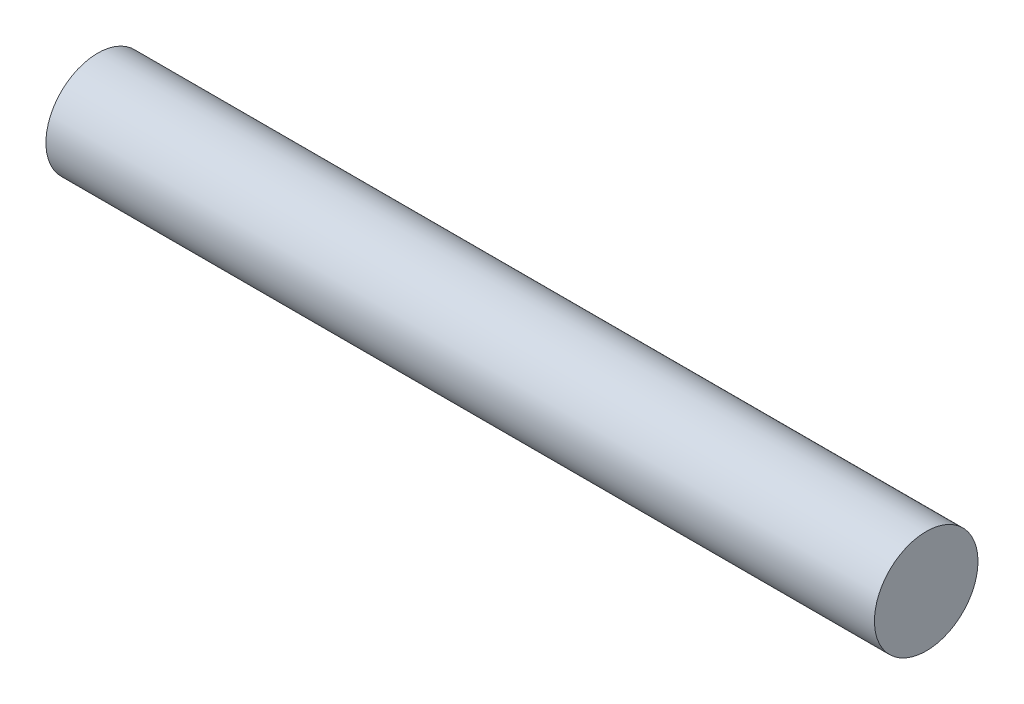
ISO-10303-21;
HEADER;
FILE_DESCRIPTION(('STEP AP214'),'2;1');
FILE_NAME('part.step','',(''),(''),'','','');
FILE_SCHEMA(('AUTOMOTIVE_DESIGN { 1 0 10303 214 1 1 1 1 }'));
ENDSEC;
DATA;
#1=APPLICATION_CONTEXT('core data for automotive mechanical design processes');
#2=APPLICATION_PROTOCOL_DEFINITION('international standard','automotive_design',2000,#1);
#3=PRODUCT_CONTEXT('',#1,'mechanical');
#4=PRODUCT('Part','Part','',(#3));
#5=PRODUCT_RELATED_PRODUCT_CATEGORY('part','',(#4));
#6=PRODUCT_DEFINITION_FORMATION('','',#4);
#7=PRODUCT_DEFINITION_CONTEXT('part definition',#1,'design');
#8=PRODUCT_DEFINITION('design','',#6,#7);
#9=PRODUCT_DEFINITION_SHAPE('','',#8);
#10=(LENGTH_UNIT() NAMED_UNIT(*) SI_UNIT(.MILLI.,.METRE.));
#11=(NAMED_UNIT(*) PLANE_ANGLE_UNIT() SI_UNIT($,.RADIAN.));
#12=(NAMED_UNIT(*) SI_UNIT($,.STERADIAN.) SOLID_ANGLE_UNIT());
#13=UNCERTAINTY_MEASURE_WITH_UNIT(LENGTH_MEASURE(1.E-05),#10,'distance_accuracy_value','');
#14=(GEOMETRIC_REPRESENTATION_CONTEXT(3) GLOBAL_UNCERTAINTY_ASSIGNED_CONTEXT((#13)) GLOBAL_UNIT_ASSIGNED_CONTEXT((#10,
#11,#12)) REPRESENTATION_CONTEXT('',''));
#15=CARTESIAN_POINT('',(0.,0.,0.));
#16=DIRECTION('',(0.,0.,1.));
#17=DIRECTION('',(1.,0.,0.));
#18=AXIS2_PLACEMENT_3D('',#15,#16,#17);
#19=CARTESIAN_POINT('',(16.,0.,0.));
#20=DIRECTION('',(-1.,0.,0.));
#21=DIRECTION('',(0.,0.,1.));
#22=AXIS2_PLACEMENT_3D('',#19,#20,#21);
#23=CYLINDRICAL_SURFACE('',#22,1.);
#24=CARTESIAN_POINT('',(16.,0.,0.));
#25=DIRECTION('',(1.,0.,0.));
#26=DIRECTION('',(0.,0.,-1.));
#27=AXIS2_PLACEMENT_3D('',#24,#25,#26);
#28=CIRCLE('',#27,1.);
#29=CARTESIAN_POINT('',(16.,0.,-1.));
#30=VERTEX_POINT('',#29);
#31=EDGE_CURVE('E10',#30,#30,#28,.T.);
#32=ORIENTED_EDGE('',*,*,#31,.F.);
#33=EDGE_LOOP('',(#32));
#34=FACE_BOUND('',#33,.T.);
#35=CARTESIAN_POINT('',(0.,0.,0.));
#36=DIRECTION('',(1.,0.,0.));
#37=DIRECTION('',(0.,0.,-1.));
#38=AXIS2_PLACEMENT_3D('',#35,#36,#37);
#39=CIRCLE('',#38,1.);
#40=CARTESIAN_POINT('',(0.,0.,-1.));
#41=VERTEX_POINT('',#40);
#42=EDGE_CURVE('E33',#41,#41,#39,.T.);
#43=ORIENTED_EDGE('',*,*,#42,.T.);
#44=EDGE_LOOP('',(#43));
#45=FACE_BOUND('',#44,.T.);
#46=ADVANCED_FACE('F30',(#34,#45),#23,.T.);
#47=CARTESIAN_POINT('',(16.,0.,0.));
#48=DIRECTION('',(1.,0.,0.));
#49=DIRECTION('',(0.,0.,-1.));
#50=AXIS2_PLACEMENT_3D('',#47,#48,#49);
#51=PLANE('',#50);
#52=ORIENTED_EDGE('',*,*,#31,.T.);
#53=EDGE_LOOP('',(#52));
#54=FACE_BOUND('',#53,.T.);
#55=ADVANCED_FACE('F45',(#54),#51,.T.);
#56=CARTESIAN_POINT('',(0.,0.,0.));
#57=DIRECTION('',(1.,0.,0.));
#58=DIRECTION('',(0.,0.,-1.));
#59=AXIS2_PLACEMENT_3D('',#56,#57,#58);
#60=PLANE('',#59);
#61=ORIENTED_EDGE('',*,*,#42,.F.);
#62=EDGE_LOOP('',(#61));
#63=FACE_BOUND('',#62,.T.);
#64=ADVANCED_FACE('F43',(#63),#60,.F.);
#65=CLOSED_SHELL('',(#46,#55,#64));
#66=MANIFOLD_SOLID_BREP('B2',#65);
#67=ADVANCED_BREP_SHAPE_REPRESENTATION('',(#18,#66),#14);
#68=SHAPE_DEFINITION_REPRESENTATION(#9,#67);
ENDSEC;
END-ISO-10303-21;
